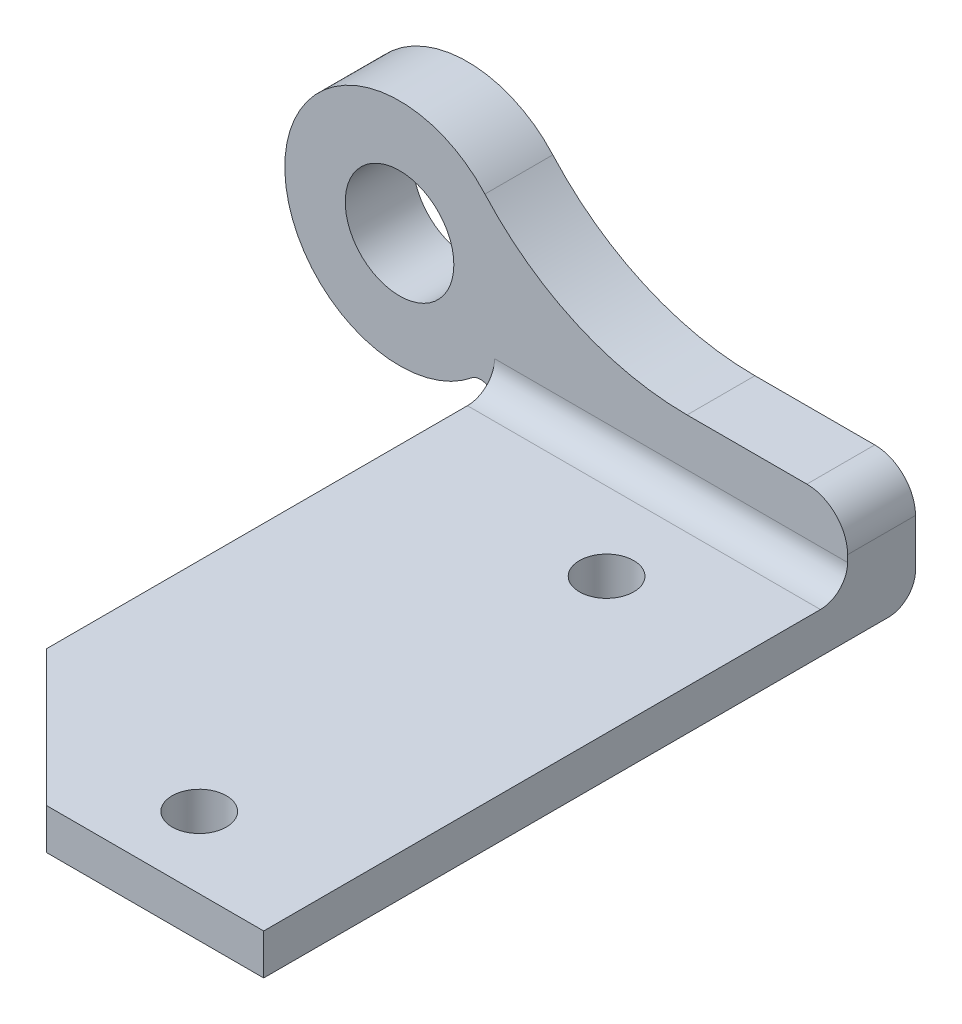
ISO-10303-21;
HEADER;
FILE_DESCRIPTION(('STEP AP214'),'2;1');
FILE_NAME('part.step','',(''),(''),'','','');
FILE_SCHEMA(('AUTOMOTIVE_DESIGN { 1 0 10303 214 1 1 1 1 }'));
ENDSEC;
DATA;
#1=APPLICATION_CONTEXT('core data for automotive mechanical design processes');
#2=APPLICATION_PROTOCOL_DEFINITION('international standard','automotive_design',2000,#1);
#3=PRODUCT_CONTEXT('',#1,'mechanical');
#4=PRODUCT('Part','Part','',(#3));
#5=PRODUCT_RELATED_PRODUCT_CATEGORY('part','',(#4));
#6=PRODUCT_DEFINITION_FORMATION('','',#4);
#7=PRODUCT_DEFINITION_CONTEXT('part definition',#1,'design');
#8=PRODUCT_DEFINITION('design','',#6,#7);
#9=PRODUCT_DEFINITION_SHAPE('','',#8);
#10=(LENGTH_UNIT() NAMED_UNIT(*) SI_UNIT(.MILLI.,.METRE.));
#11=(NAMED_UNIT(*) PLANE_ANGLE_UNIT() SI_UNIT($,.RADIAN.));
#12=(NAMED_UNIT(*) SI_UNIT($,.STERADIAN.) SOLID_ANGLE_UNIT());
#13=UNCERTAINTY_MEASURE_WITH_UNIT(LENGTH_MEASURE(1.E-05),#10,'distance_accuracy_value','');
#14=(GEOMETRIC_REPRESENTATION_CONTEXT(3) GLOBAL_UNCERTAINTY_ASSIGNED_CONTEXT((#13)) GLOBAL_UNIT_ASSIGNED_CONTEXT((#10,
#11,#12)) REPRESENTATION_CONTEXT('',''));
#15=CARTESIAN_POINT('',(0.,0.,0.));
#16=DIRECTION('',(0.,0.,1.));
#17=DIRECTION('',(1.,0.,0.));
#18=AXIS2_PLACEMENT_3D('',#15,#16,#17);
#19=CARTESIAN_POINT('',(8.71716610809906,5.2407015789691,-2.));
#20=DIRECTION('',(0.,0.,1.));
#21=DIRECTION('',(1.,0.,0.));
#22=AXIS2_PLACEMENT_3D('',#19,#20,#21);
#23=CYLINDRICAL_SURFACE('',#22,20.0000000000031);
#24=DIRECTION('',(0.,0.,1.));
#25=VECTOR('',#24,1.);
#26=CARTESIAN_POINT('',(-6.16896150007952,-8.11606467761962,-2.));
#27=LINE('',#26,#25);
#28=CARTESIAN_POINT('',(-6.16896150007952,-8.11606467761962,-2.));
#29=VERTEX_POINT('',#28);
#30=CARTESIAN_POINT('',(-6.16896150007952,-8.11606467761962,3.));
#31=VERTEX_POINT('',#30);
#32=EDGE_CURVE('E210',#29,#31,#27,.T.);
#33=ORIENTED_EDGE('',*,*,#32,.T.);
#34=CARTESIAN_POINT('',(8.71716610809906,5.2407015789691,3.));
#35=DIRECTION('',(0.,0.,1.));
#36=DIRECTION('',(1.,0.,0.));
#37=AXIS2_PLACEMENT_3D('',#34,#35,#36);
#38=CIRCLE('',#37,20.0000000000031);
#39=CARTESIAN_POINT('',(8.71716610809906,-14.759298421034,3.));
#40=VERTEX_POINT('',#39);
#41=EDGE_CURVE('E172',#31,#40,#38,.T.);
#42=ORIENTED_EDGE('',*,*,#41,.T.);
#43=DIRECTION('',(0.,0.,1.));
#44=VECTOR('',#43,1.);
#45=CARTESIAN_POINT('',(8.71716610809906,-14.759298421034,-2.));
#46=LINE('',#45,#44);
#47=CARTESIAN_POINT('',(8.71716610809906,-14.759298421034,-2.));
#48=VERTEX_POINT('',#47);
#49=EDGE_CURVE('E211',#48,#40,#46,.T.);
#50=ORIENTED_EDGE('',*,*,#49,.F.);
#51=CARTESIAN_POINT('',(8.71716610809906,5.2407015789691,-2.));
#52=DIRECTION('',(0.,0.,1.));
#53=DIRECTION('',(1.,0.,0.));
#54=AXIS2_PLACEMENT_3D('',#51,#52,#53);
#55=CIRCLE('',#54,20.0000000000031);
#56=EDGE_CURVE('E192',#29,#48,#55,.T.);
#57=ORIENTED_EDGE('',*,*,#56,.F.);
#58=EDGE_LOOP('',(#33,#42,#50,#57));
#59=FACE_BOUND('',#58,.T.);
#60=ADVANCED_FACE('F45',(#59),#23,.F.);
#61=CARTESIAN_POINT('',(0.,-14.759298421034,-2.));
#62=DIRECTION('',(0.,1.,0.));
#63=DIRECTION('',(0.,0.,1.));
#64=AXIS2_PLACEMENT_3D('',#61,#62,#63);
#65=PLANE('',#64);
#66=ORIENTED_EDGE('',*,*,#49,.T.);
#67=DIRECTION('',(-1.,0.,0.));
#68=VECTOR('',#67,1.);
#69=CARTESIAN_POINT('',(0.,-14.759298421034,3.));
#70=LINE('',#69,#68);
#71=CARTESIAN_POINT('',(17.5416495854691,-14.759298421034,3.));
#72=VERTEX_POINT('',#71);
#73=EDGE_CURVE('E186',#72,#40,#70,.T.);
#74=ORIENTED_EDGE('',*,*,#73,.F.);
#75=DIRECTION('',(0.,0.,1.));
#76=VECTOR('',#75,1.);
#77=CARTESIAN_POINT('',(17.5416495854691,-14.759298421034,-2.));
#78=LINE('',#77,#76);
#79=CARTESIAN_POINT('',(17.5416495854691,-14.759298421034,-2.));
#80=VERTEX_POINT('',#79);
#81=EDGE_CURVE('E213',#80,#72,#78,.T.);
#82=ORIENTED_EDGE('',*,*,#81,.F.);
#83=DIRECTION('',(-1.,0.,0.));
#84=VECTOR('',#83,1.);
#85=CARTESIAN_POINT('',(0.,-14.759298421034,-2.));
#86=LINE('',#85,#84);
#87=EDGE_CURVE('E207',#80,#48,#86,.T.);
#88=ORIENTED_EDGE('',*,*,#87,.T.);
#89=EDGE_LOOP('',(#66,#74,#82,#88));
#90=FACE_BOUND('',#89,.T.);
#91=ADVANCED_FACE('F285',(#90),#65,.T.);
#92=CARTESIAN_POINT('',(17.5416495854691,-17.759298421034,-2.));
#93=DIRECTION('',(0.,0.,1.));
#94=DIRECTION('',(1.,0.,0.));
#95=AXIS2_PLACEMENT_3D('',#92,#93,#94);
#96=CYLINDRICAL_SURFACE('',#95,3.);
#97=ORIENTED_EDGE('',*,*,#81,.T.);
#98=CARTESIAN_POINT('',(17.5416495854691,-17.759298421034,3.));
#99=DIRECTION('',(0.,0.,1.));
#100=DIRECTION('',(1.,0.,0.));
#101=AXIS2_PLACEMENT_3D('',#98,#99,#100);
#102=CIRCLE('',#101,3.);
#103=CARTESIAN_POINT('',(20.5416495854691,-17.759298421034,3.));
#104=VERTEX_POINT('',#103);
#105=EDGE_CURVE('E183',#104,#72,#102,.T.);
#106=ORIENTED_EDGE('',*,*,#105,.F.);
#107=DIRECTION('',(0.,0.,1.));
#108=VECTOR('',#107,1.);
#109=CARTESIAN_POINT('',(20.5416495854691,-17.759298421034,-2.));
#110=LINE('',#109,#108);
#111=CARTESIAN_POINT('',(20.5416495854691,-17.759298421034,-2.));
#112=VERTEX_POINT('',#111);
#113=EDGE_CURVE('E215',#112,#104,#110,.T.);
#114=ORIENTED_EDGE('',*,*,#113,.F.);
#115=CARTESIAN_POINT('',(17.5416495854691,-17.759298421034,-2.));
#116=DIRECTION('',(0.,0.,1.));
#117=DIRECTION('',(1.,0.,0.));
#118=AXIS2_PLACEMENT_3D('',#115,#116,#117);
#119=CIRCLE('',#118,3.);
#120=EDGE_CURVE('E204',#112,#80,#119,.T.);
#121=ORIENTED_EDGE('',*,*,#120,.T.);
#122=EDGE_LOOP('',(#97,#106,#114,#121));
#123=FACE_BOUND('',#122,.T.);
#124=ADVANCED_FACE('F288',(#123),#96,.T.);
#125=CARTESIAN_POINT('',(20.5416495854691,0.,-2.));
#126=DIRECTION('',(1.,0.,0.));
#127=DIRECTION('',(0.,0.,-1.));
#128=AXIS2_PLACEMENT_3D('',#125,#126,#127);
#129=PLANE('',#128);
#130=DIRECTION('',(0.,0.,1.));
#131=VECTOR('',#130,1.);
#132=CARTESIAN_POINT('',(20.5416495854682,-23.2592984210307,-2.));
#133=LINE('',#132,#131);
#134=CARTESIAN_POINT('',(20.5416495854682,-23.2592984210307,0.));
#135=VERTEX_POINT('',#134);
#136=CARTESIAN_POINT('',(20.5416495854682,-23.2592984210307,46.0047828549212));
#137=VERTEX_POINT('',#136);
#138=EDGE_CURVE('E218',#135,#137,#133,.T.);
#139=ORIENTED_EDGE('',*,*,#138,.F.);
#140=CARTESIAN_POINT('',(20.5416495854691,-21.2592984210307,0.));
#141=DIRECTION('',(1.,0.,0.));
#142=DIRECTION('',(0.,0.,-1.));
#143=AXIS2_PLACEMENT_3D('',#140,#141,#142);
#144=CIRCLE('',#143,2.);
#145=CARTESIAN_POINT('',(20.5416495854691,-21.2592984210307,-2.));
#146=VERTEX_POINT('',#145);
#147=EDGE_CURVE('E237',#135,#146,#144,.T.);
#148=ORIENTED_EDGE('',*,*,#147,.T.);
#149=DIRECTION('',(0.,1.,0.));
#150=VECTOR('',#149,1.);
#151=CARTESIAN_POINT('',(20.5416495854691,0.,-2.));
#152=LINE('',#151,#150);
#153=EDGE_CURVE('E202',#146,#112,#152,.T.);
#154=ORIENTED_EDGE('',*,*,#153,.T.);
#155=ORIENTED_EDGE('',*,*,#113,.T.);
#156=DIRECTION('',(0.,1.,0.));
#157=VECTOR('',#156,1.);
#158=CARTESIAN_POINT('',(20.5416495854691,0.,3.));
#159=LINE('',#158,#157);
#160=CARTESIAN_POINT('',(20.5416495854691,-18.2592984210307,3.));
#161=VERTEX_POINT('',#160);
#162=EDGE_CURVE('E181',#161,#104,#159,.T.);
#163=ORIENTED_EDGE('',*,*,#162,.F.);
#164=CARTESIAN_POINT('',(20.5416495854691,-18.2592984210307,5.));
#165=DIRECTION('',(1.,0.,0.));
#166=DIRECTION('',(0.,0.,-1.));
#167=AXIS2_PLACEMENT_3D('',#164,#165,#166);
#168=CIRCLE('',#167,2.);
#169=CARTESIAN_POINT('',(20.5416495854682,-20.2592984210307,5.));
#170=VERTEX_POINT('',#169);
#171=EDGE_CURVE('E11',#161,#170,#168,.F.);
#172=ORIENTED_EDGE('',*,*,#171,.T.);
#173=DIRECTION('',(0.,0.,1.));
#174=VECTOR('',#173,1.);
#175=CARTESIAN_POINT('',(20.5416495854682,-20.2592984210307,46.0047828549212));
#176=LINE('',#175,#174);
#177=CARTESIAN_POINT('',(20.5416495854682,-20.2592984210307,46.0047828549212));
#178=VERTEX_POINT('',#177);
#179=EDGE_CURVE('E138',#170,#178,#176,.T.);
#180=ORIENTED_EDGE('',*,*,#179,.T.);
#181=DIRECTION('',(0.,-1.,0.));
#182=VECTOR('',#181,1.);
#183=CARTESIAN_POINT('',(20.5416495854682,-20.2592984210307,46.0047828549212));
#184=LINE('',#183,#182);
#185=EDGE_CURVE('E142',#178,#137,#184,.T.);
#186=ORIENTED_EDGE('',*,*,#185,.T.);
#187=EDGE_LOOP('',(#139,#148,#154,#155,#163,#172,#180,#186));
#188=FACE_BOUND('',#187,.T.);
#189=ADVANCED_FACE('F141',(#188),#129,.T.);
#190=CARTESIAN_POINT('',(0.,-23.2592984210307,-2.));
#191=DIRECTION('',(0.,1.,0.));
#192=DIRECTION('',(0.,0.,1.));
#193=AXIS2_PLACEMENT_3D('',#190,#191,#192);
#194=PLANE('',#193);
#195=DIRECTION('',(-0.999999983085607,0.,-0.000183926029933874));
#196=VECTOR('',#195,1.);
#197=CARTESIAN_POINT('',(20.5416495854682,-23.2592984210307,46.0047828549212));
#198=LINE('',#197,#196);
#199=CARTESIAN_POINT('',(4.5434891841508,-23.2592984210307,46.0018403767426));
#200=VERTEX_POINT('',#199);
#201=EDGE_CURVE('E158',#137,#200,#198,.T.);
#202=ORIENTED_EDGE('',*,*,#201,.T.);
#203=DIRECTION('',(0.707106781186546,0.,0.707106781186549));
#204=VECTOR('',#203,1.);
#205=CARTESIAN_POINT('',(4.54348918414873,-23.2592984210307,46.0018403767405));
#206=LINE('',#205,#204);
#207=CARTESIAN_POINT('',(-5.45835041453181,-23.2592984210307,36.0000007780627));
#208=VERTEX_POINT('',#207);
#209=EDGE_CURVE('E241',#200,#208,#206,.F.);
#210=ORIENTED_EDGE('',*,*,#209,.T.);
#211=DIRECTION('',(0.,0.,1.));
#212=VECTOR('',#211,1.);
#213=CARTESIAN_POINT('',(-5.45835041453181,-23.2592984210307,-2.));
#214=LINE('',#213,#212);
#215=CARTESIAN_POINT('',(-5.45835041453181,-23.2592984210307,0.));
#216=VERTEX_POINT('',#215);
#217=EDGE_CURVE('E220',#216,#208,#214,.T.);
#218=ORIENTED_EDGE('',*,*,#217,.F.);
#219=DIRECTION('',(-1.,0.,0.));
#220=VECTOR('',#219,1.);
#221=CARTESIAN_POINT('',(0.,-23.2592984210307,0.));
#222=LINE('',#221,#220);
#223=EDGE_CURVE('E235',#216,#135,#222,.F.);
#224=ORIENTED_EDGE('',*,*,#223,.T.);
#225=ORIENTED_EDGE('',*,*,#138,.T.);
#226=EDGE_LOOP('',(#202,#210,#218,#224,#225));
#227=FACE_BOUND('',#226,.T.);
#228=CARTESIAN_POINT('',(10.5416495854728,-23.2592984210307,10.7504394506908));
#229=DIRECTION('',(0.,-1.,0.));
#230=DIRECTION('',(0.,0.,-1.));
#231=AXIS2_PLACEMENT_3D('',#228,#229,#230);
#232=CIRCLE('',#231,2.);
#233=CARTESIAN_POINT('',(10.5416495854728,-23.2592984210307,8.75043945069076));
#234=VERTEX_POINT('',#233);
#235=EDGE_CURVE('E346',#234,#234,#232,.T.);
#236=ORIENTED_EDGE('',*,*,#235,.F.);
#237=EDGE_LOOP('',(#236));
#238=FACE_BOUND('',#237,.T.);
#239=CARTESIAN_POINT('',(10.5416495854727,-23.2592984210307,40.7504394506913));
#240=DIRECTION('',(0.,-1.,0.));
#241=DIRECTION('',(0.,0.,-1.));
#242=AXIS2_PLACEMENT_3D('',#239,#240,#241);
#243=CIRCLE('',#242,2.);
#244=CARTESIAN_POINT('',(10.5416495854727,-23.2592984210307,38.7504394506913));
#245=VERTEX_POINT('',#244);
#246=EDGE_CURVE('E348',#245,#245,#243,.T.);
#247=ORIENTED_EDGE('',*,*,#246,.F.);
#248=EDGE_LOOP('',(#247));
#249=FACE_BOUND('',#248,.T.);
#250=ADVANCED_FACE('F256',(#227,#238,#249),#194,.F.);
#251=CARTESIAN_POINT('',(-5.45835041456107,-7.51245318596319E-12,-2.));
#252=DIRECTION('',(-1.,-1.37632299420031E-12,0.));
#253=DIRECTION('',(1.37632299420031E-12,-1.,0.));
#254=AXIS2_PLACEMENT_3D('',#251,#252,#253);
#255=PLANE('',#254);
#256=ORIENTED_EDGE('',*,*,#217,.T.);
#257=DIRECTION('',(-1.37632299420031E-12,1.,0.));
#258=VECTOR('',#257,1.);
#259=CARTESIAN_POINT('',(-5.45835041456107,-7.50283380388278E-12,36.0000007780627));
#260=LINE('',#259,#258);
#261=CARTESIAN_POINT('',(-5.45835041453182,-20.2592984210307,36.0000007780627));
#262=VERTEX_POINT('',#261);
#263=EDGE_CURVE('E243',#208,#262,#260,.T.);
#264=ORIENTED_EDGE('',*,*,#263,.T.);
#265=DIRECTION('',(0.,0.,-1.));
#266=VECTOR('',#265,1.);
#267=CARTESIAN_POINT('',(-5.45835041453182,-20.2592984210307,46.0000007780621));
#268=LINE('',#267,#266);
#269=CARTESIAN_POINT('',(-5.45835041453181,-20.2592984210307,5.));
#270=VERTEX_POINT('',#269);
#271=EDGE_CURVE('E150',#262,#270,#268,.T.);
#272=ORIENTED_EDGE('',*,*,#271,.T.);
#273=CARTESIAN_POINT('',(-5.45835041453594,-18.2592984210307,5.));
#274=DIRECTION('',(-1.,-1.37632299420031E-12,0.));
#275=DIRECTION('',(1.37632299420031E-12,-1.,0.));
#276=AXIS2_PLACEMENT_3D('',#273,#274,#275);
#277=CIRCLE('',#276,2.);
#278=CARTESIAN_POINT('',(-5.45835041453181,-18.2592984210307,3.));
#279=VERTEX_POINT('',#278);
#280=EDGE_CURVE('E53',#270,#279,#277,.F.);
#281=ORIENTED_EDGE('',*,*,#280,.T.);
#282=DIRECTION('',(0.,-1.,0.));
#283=VECTOR('',#282,1.);
#284=CARTESIAN_POINT('',(-5.45835041453181,0.,3.));
#285=LINE('',#284,#283);
#286=CARTESIAN_POINT('',(-5.45835041453181,-21.0601545352171,3.));
#287=VERTEX_POINT('',#286);
#288=EDGE_CURVE('E60',#279,#287,#285,.T.);
#289=ORIENTED_EDGE('',*,*,#288,.T.);
#290=DIRECTION('',(0.,0.,1.));
#291=VECTOR('',#290,1.);
#292=CARTESIAN_POINT('',(-5.45835041453209,-21.0601545352137,-2.));
#293=LINE('',#292,#291);
#294=CARTESIAN_POINT('',(-5.45835041453209,-21.0601545352137,-2.));
#295=VERTEX_POINT('',#294);
#296=EDGE_CURVE('E223',#295,#287,#293,.T.);
#297=ORIENTED_EDGE('',*,*,#296,.F.);
#298=DIRECTION('',(1.37632299420031E-12,-1.,0.));
#299=VECTOR('',#298,1.);
#300=CARTESIAN_POINT('',(-5.45835041456107,-7.51245318596319E-12,-2.));
#301=LINE('',#300,#299);
#302=CARTESIAN_POINT('',(-5.45835041453181,-21.2592984210307,-2.));
#303=VERTEX_POINT('',#302);
#304=EDGE_CURVE('E199',#295,#303,#301,.T.);
#305=ORIENTED_EDGE('',*,*,#304,.T.);
#306=CARTESIAN_POINT('',(-5.45835041453181,-21.2592984210307,0.));
#307=DIRECTION('',(-1.,-1.37632299420031E-12,0.));
#308=DIRECTION('',(1.37632299420031E-12,-1.,0.));
#309=AXIS2_PLACEMENT_3D('',#306,#307,#308);
#310=CIRCLE('',#309,2.);
#311=EDGE_CURVE('E233',#303,#216,#310,.T.);
#312=ORIENTED_EDGE('',*,*,#311,.T.);
#313=EDGE_LOOP('',(#256,#264,#272,#281,#289,#297,#305,#312));
#314=FACE_BOUND('',#313,.T.);
#315=ADVANCED_FACE('F250',(#314),#255,.T.);
#316=CARTESIAN_POINT('',(-6.49822931459182,-21.1445458718312,-2.));
#317=DIRECTION('',(0.,0.,1.));
#318=DIRECTION('',(1.,0.,0.));
#319=AXIS2_PLACEMENT_3D('',#316,#317,#318);
#320=CYLINDRICAL_SURFACE('',#319,1.0432976682067);
#321=ORIENTED_EDGE('',*,*,#296,.T.);
#322=CARTESIAN_POINT('',(-6.49822931459182,-21.1445458718312,3.));
#323=DIRECTION('',(0.,0.,1.));
#324=DIRECTION('',(1.,0.,0.));
#325=AXIS2_PLACEMENT_3D('',#322,#323,#324);
#326=CIRCLE('',#325,1.0432976682067);
#327=CARTESIAN_POINT('',(-7.09327104945139,-20.2875771686332,3.));
#328=VERTEX_POINT('',#327);
#329=EDGE_CURVE('E178',#287,#328,#326,.T.);
#330=ORIENTED_EDGE('',*,*,#329,.T.);
#331=DIRECTION('',(0.,0.,1.));
#332=VECTOR('',#331,1.);
#333=CARTESIAN_POINT('',(-7.09327104945139,-20.2875771686332,-2.));
#334=LINE('',#333,#332);
#335=CARTESIAN_POINT('',(-7.09327104945139,-20.2875771686332,-2.));
#336=VERTEX_POINT('',#335);
#337=EDGE_CURVE('E226',#336,#328,#334,.T.);
#338=ORIENTED_EDGE('',*,*,#337,.F.);
#339=CARTESIAN_POINT('',(-6.49822931459182,-21.1445458718312,-2.));
#340=DIRECTION('',(0.,0.,1.));
#341=DIRECTION('',(1.,0.,0.));
#342=AXIS2_PLACEMENT_3D('',#339,#340,#341);
#343=CIRCLE('',#342,1.0432976682067);
#344=EDGE_CURVE('E197',#295,#336,#343,.T.);
#345=ORIENTED_EDGE('',*,*,#344,.F.);
#346=EDGE_LOOP('',(#321,#330,#338,#345));
#347=FACE_BOUND('',#346,.T.);
#348=ADVANCED_FACE('F273',(#347),#320,.F.);
#349=CARTESIAN_POINT('',(-12.4583504145318,-13.7592984210307,-2.));
#350=DIRECTION('',(0.,0.,1.));
#351=DIRECTION('',(1.,0.,0.));
#352=AXIS2_PLACEMENT_3D('',#349,#350,#351);
#353=CYLINDRICAL_SURFACE('',#352,4.);
#354=CARTESIAN_POINT('',(-12.4583504145318,-13.7592984210307,-2.));
#355=DIRECTION('',(0.,0.,1.));
#356=DIRECTION('',(1.,0.,0.));
#357=AXIS2_PLACEMENT_3D('',#354,#355,#356);
#358=CIRCLE('',#357,4.);
#359=CARTESIAN_POINT('',(-8.45835041453181,-13.7592984210307,-2.));
#360=VERTEX_POINT('',#359);
#361=EDGE_CURVE('E189',#360,#360,#358,.T.);
#362=ORIENTED_EDGE('',*,*,#361,.F.);
#363=EDGE_LOOP('',(#362));
#364=FACE_BOUND('',#363,.T.);
#365=CARTESIAN_POINT('',(-12.4583504145318,-13.7592984210307,3.));
#366=DIRECTION('',(0.,0.,1.));
#367=DIRECTION('',(1.,0.,0.));
#368=AXIS2_PLACEMENT_3D('',#365,#366,#367);
#369=CIRCLE('',#368,4.);
#370=CARTESIAN_POINT('',(-8.45835041453181,-13.7592984210307,3.));
#371=VERTEX_POINT('',#370);
#372=EDGE_CURVE('E159',#371,#371,#369,.T.);
#373=ORIENTED_EDGE('',*,*,#372,.T.);
#374=EDGE_LOOP('',(#373));
#375=FACE_BOUND('',#374,.T.);
#376=ADVANCED_FACE('F296',(#364,#375),#353,.F.);
#377=CARTESIAN_POINT('',(-12.4583504145309,-13.7592984210308,-2.));
#378=DIRECTION('',(0.,0.,1.));
#379=DIRECTION('',(1.,0.,0.));
#380=AXIS2_PLACEMENT_3D('',#377,#378,#379);
#381=CYLINDRICAL_SURFACE('',#380,8.44999999999993);
#382=ORIENTED_EDGE('',*,*,#337,.T.);
#383=CARTESIAN_POINT('',(-12.4583504145309,-13.7592984210308,3.));
#384=DIRECTION('',(0.,0.,1.));
#385=DIRECTION('',(1.,0.,0.));
#386=AXIS2_PLACEMENT_3D('',#383,#384,#385);
#387=CIRCLE('',#386,8.44999999999993);
#388=EDGE_CURVE('E175',#31,#328,#387,.T.);
#389=ORIENTED_EDGE('',*,*,#388,.F.);
#390=ORIENTED_EDGE('',*,*,#32,.F.);
#391=CARTESIAN_POINT('',(-12.4583504145309,-13.7592984210308,-2.));
#392=DIRECTION('',(0.,0.,1.));
#393=DIRECTION('',(1.,0.,0.));
#394=AXIS2_PLACEMENT_3D('',#391,#392,#393);
#395=CIRCLE('',#394,8.44999999999993);
#396=EDGE_CURVE('E194',#29,#336,#395,.T.);
#397=ORIENTED_EDGE('',*,*,#396,.T.);
#398=EDGE_LOOP('',(#382,#389,#390,#397));
#399=FACE_BOUND('',#398,.T.);
#400=ADVANCED_FACE('F279',(#399),#381,.T.);
#401=CARTESIAN_POINT('',(0.,0.,-2.));
#402=DIRECTION('',(0.,0.,1.));
#403=DIRECTION('',(1.,0.,0.));
#404=AXIS2_PLACEMENT_3D('',#401,#402,#403);
#405=PLANE('',#404);
#406=ORIENTED_EDGE('',*,*,#153,.F.);
#407=DIRECTION('',(-1.,0.,0.));
#408=VECTOR('',#407,1.);
#409=CARTESIAN_POINT('',(0.,-21.2592984210307,-2.));
#410=LINE('',#409,#408);
#411=EDGE_CURVE('E230',#146,#303,#410,.T.);
#412=ORIENTED_EDGE('',*,*,#411,.T.);
#413=ORIENTED_EDGE('',*,*,#304,.F.);
#414=ORIENTED_EDGE('',*,*,#344,.T.);
#415=ORIENTED_EDGE('',*,*,#396,.F.);
#416=ORIENTED_EDGE('',*,*,#56,.T.);
#417=ORIENTED_EDGE('',*,*,#87,.F.);
#418=ORIENTED_EDGE('',*,*,#120,.F.);
#419=EDGE_LOOP('',(#406,#412,#413,#414,#415,#416,#417,#418));
#420=FACE_BOUND('',#419,.T.);
#421=ORIENTED_EDGE('',*,*,#361,.T.);
#422=EDGE_LOOP('',(#421));
#423=FACE_BOUND('',#422,.T.);
#424=ADVANCED_FACE('F267',(#420,#423),#405,.F.);
#425=CARTESIAN_POINT('',(0.,0.,3.));
#426=DIRECTION('',(0.,0.,1.));
#427=DIRECTION('',(1.,0.,0.));
#428=AXIS2_PLACEMENT_3D('',#425,#426,#427);
#429=PLANE('',#428);
#430=ORIENTED_EDGE('',*,*,#288,.F.);
#431=DIRECTION('',(-1.,0.,0.));
#432=VECTOR('',#431,1.);
#433=CARTESIAN_POINT('',(20.5416495854682,-18.2592984210307,3.));
#434=LINE('',#433,#432);
#435=EDGE_CURVE('E65',#279,#161,#434,.F.);
#436=ORIENTED_EDGE('',*,*,#435,.T.);
#437=ORIENTED_EDGE('',*,*,#162,.T.);
#438=ORIENTED_EDGE('',*,*,#105,.T.);
#439=ORIENTED_EDGE('',*,*,#73,.T.);
#440=ORIENTED_EDGE('',*,*,#41,.F.);
#441=ORIENTED_EDGE('',*,*,#388,.T.);
#442=ORIENTED_EDGE('',*,*,#329,.F.);
#443=EDGE_LOOP('',(#430,#436,#437,#438,#439,#440,#441,#442));
#444=FACE_BOUND('',#443,.T.);
#445=ORIENTED_EDGE('',*,*,#372,.F.);
#446=EDGE_LOOP('',(#445));
#447=FACE_BOUND('',#446,.T.);
#448=ADVANCED_FACE('F290',(#444,#447),#429,.T.);
#449=CARTESIAN_POINT('',(20.5416495854682,-20.2592984210307,46.0047828549212));
#450=DIRECTION('',(-0.000183926029933874,0.,0.999999983085608));
#451=DIRECTION('',(0.999999983085608,0.,0.000183926029933874));
#452=AXIS2_PLACEMENT_3D('',#449,#450,#451);
#453=PLANE('',#452);
#454=DIRECTION('',(-0.999999983085607,0.,-0.000183926029933874));
#455=VECTOR('',#454,1.);
#456=CARTESIAN_POINT('',(20.5416495854682,-20.2592984210307,46.0047828549212));
#457=LINE('',#456,#455);
#458=CARTESIAN_POINT('',(4.54348918414667,-20.2592984210307,46.0018403767426));
#459=VERTEX_POINT('',#458);
#460=EDGE_CURVE('E149',#178,#459,#457,.T.);
#461=ORIENTED_EDGE('',*,*,#460,.T.);
#462=DIRECTION('',(1.37632299420031E-12,-1.,0.));
#463=VECTOR('',#462,1.);
#464=CARTESIAN_POINT('',(4.54348918414666,-20.2592984210527,46.0018403767426));
#465=LINE('',#464,#463);
#466=EDGE_CURVE('E239',#459,#200,#465,.T.);
#467=ORIENTED_EDGE('',*,*,#466,.T.);
#468=ORIENTED_EDGE('',*,*,#201,.F.);
#469=ORIENTED_EDGE('',*,*,#185,.F.);
#470=EDGE_LOOP('',(#461,#467,#468,#469));
#471=FACE_BOUND('',#470,.T.);
#472=ADVANCED_FACE('F154',(#471),#453,.T.);
#473=CARTESIAN_POINT('',(0.,-20.2592984210307,0.));
#474=DIRECTION('',(0.,1.,0.));
#475=DIRECTION('',(0.,0.,1.));
#476=AXIS2_PLACEMENT_3D('',#473,#474,#475);
#477=PLANE('',#476);
#478=CARTESIAN_POINT('',(10.5416495854728,-20.2592984210307,10.7504394506908));
#479=DIRECTION('',(0.,-1.,0.));
#480=DIRECTION('',(0.,0.,-1.));
#481=AXIS2_PLACEMENT_3D('',#478,#479,#480);
#482=CIRCLE('',#481,2.);
#483=CARTESIAN_POINT('',(10.5416495854728,-20.2592984210307,8.75043945069076));
#484=VERTEX_POINT('',#483);
#485=EDGE_CURVE('E343',#484,#484,#482,.T.);
#486=ORIENTED_EDGE('',*,*,#485,.T.);
#487=EDGE_LOOP('',(#486));
#488=FACE_BOUND('',#487,.T.);
#489=CARTESIAN_POINT('',(10.5416495854727,-20.2592984210307,40.7504394506913));
#490=DIRECTION('',(0.,-1.,0.));
#491=DIRECTION('',(0.,0.,-1.));
#492=AXIS2_PLACEMENT_3D('',#489,#490,#491);
#493=CIRCLE('',#492,2.);
#494=CARTESIAN_POINT('',(10.5416495854727,-20.2592984210307,38.7504394506913));
#495=VERTEX_POINT('',#494);
#496=EDGE_CURVE('E168',#495,#495,#493,.T.);
#497=ORIENTED_EDGE('',*,*,#496,.T.);
#498=EDGE_LOOP('',(#497));
#499=FACE_BOUND('',#498,.T.);
#500=ORIENTED_EDGE('',*,*,#179,.F.);
#501=DIRECTION('',(-1.,0.,0.));
#502=VECTOR('',#501,1.);
#503=CARTESIAN_POINT('',(-5.45835041453181,-20.2592984210307,5.));
#504=LINE('',#503,#502);
#505=EDGE_CURVE('E246',#170,#270,#504,.T.);
#506=ORIENTED_EDGE('',*,*,#505,.T.);
#507=ORIENTED_EDGE('',*,*,#271,.F.);
#508=DIRECTION('',(-0.707106781186546,0.,-0.707106781186549));
#509=VECTOR('',#508,1.);
#510=CARTESIAN_POINT('',(-20.729175596298,-20.2592984210307,20.7291755962979));
#511=LINE('',#510,#509);
#512=EDGE_CURVE('E164',#262,#459,#511,.F.);
#513=ORIENTED_EDGE('',*,*,#512,.T.);
#514=ORIENTED_EDGE('',*,*,#460,.F.);
#515=EDGE_LOOP('',(#500,#506,#507,#513,#514));
#516=FACE_BOUND('',#515,.T.);
#517=ADVANCED_FACE('F161',(#488,#499,#516),#477,.T.);
#518=CARTESIAN_POINT('',(10.5416495854727,-20.2592984210307,40.7504394506913));
#519=DIRECTION('',(0.,-1.,0.));
#520=DIRECTION('',(0.,0.,-1.));
#521=AXIS2_PLACEMENT_3D('',#518,#519,#520);
#522=CYLINDRICAL_SURFACE('',#521,2.);
#523=ORIENTED_EDGE('',*,*,#496,.F.);
#524=EDGE_LOOP('',(#523));
#525=FACE_BOUND('',#524,.T.);
#526=ORIENTED_EDGE('',*,*,#246,.T.);
#527=EDGE_LOOP('',(#526));
#528=FACE_BOUND('',#527,.T.);
#529=ADVANCED_FACE('F329',(#525,#528),#522,.F.);
#530=CARTESIAN_POINT('',(10.5416495854728,-20.2592984210307,10.7504394506908));
#531=DIRECTION('',(0.,-1.,0.));
#532=DIRECTION('',(0.,0.,-1.));
#533=AXIS2_PLACEMENT_3D('',#530,#531,#532);
#534=CYLINDRICAL_SURFACE('',#533,2.);
#535=ORIENTED_EDGE('',*,*,#485,.F.);
#536=EDGE_LOOP('',(#535));
#537=FACE_BOUND('',#536,.T.);
#538=ORIENTED_EDGE('',*,*,#235,.T.);
#539=EDGE_LOOP('',(#538));
#540=FACE_BOUND('',#539,.T.);
#541=ADVANCED_FACE('F333',(#537,#540),#534,.F.);
#542=CARTESIAN_POINT('',(0.,-21.2592984210307,0.));
#543=DIRECTION('',(-1.,0.,0.));
#544=DIRECTION('',(0.,0.,1.));
#545=AXIS2_PLACEMENT_3D('',#542,#543,#544);
#546=CYLINDRICAL_SURFACE('',#545,2.);
#547=ORIENTED_EDGE('',*,*,#147,.F.);
#548=ORIENTED_EDGE('',*,*,#223,.F.);
#549=ORIENTED_EDGE('',*,*,#311,.F.);
#550=ORIENTED_EDGE('',*,*,#411,.F.);
#551=EDGE_LOOP('',(#547,#548,#549,#550));
#552=FACE_BOUND('',#551,.T.);
#553=ADVANCED_FACE('F264',(#552),#546,.T.);
#554=CARTESIAN_POINT('',(4.54348918414666,-20.2592984210527,46.0018403767426));
#555=DIRECTION('',(0.707106781186549,9.73028324139892E-13,-0.707106781186546));
#556=DIRECTION('',(1.37632299420031E-12,-1.,0.));
#557=AXIS2_PLACEMENT_3D('',#554,#555,#556);
#558=PLANE('',#557);
#559=ORIENTED_EDGE('',*,*,#512,.F.);
#560=ORIENTED_EDGE('',*,*,#263,.F.);
#561=ORIENTED_EDGE('',*,*,#209,.F.);
#562=ORIENTED_EDGE('',*,*,#466,.F.);
#563=EDGE_LOOP('',(#559,#560,#561,#562));
#564=FACE_BOUND('',#563,.T.);
#565=ADVANCED_FACE('F254',(#564),#558,.F.);
#566=CARTESIAN_POINT('',(0.,-18.2592984210307,5.));
#567=DIRECTION('',(1.,0.,0.));
#568=DIRECTION('',(0.,0.,-1.));
#569=AXIS2_PLACEMENT_3D('',#566,#567,#568);
#570=CYLINDRICAL_SURFACE('',#569,2.);
#571=ORIENTED_EDGE('',*,*,#171,.F.);
#572=ORIENTED_EDGE('',*,*,#435,.F.);
#573=ORIENTED_EDGE('',*,*,#280,.F.);
#574=ORIENTED_EDGE('',*,*,#505,.F.);
#575=EDGE_LOOP('',(#571,#572,#573,#574));
#576=FACE_BOUND('',#575,.T.);
#577=ADVANCED_FACE('F47',(#576),#570,.F.);
#578=CLOSED_SHELL('',(#60,#91,#124,#189,#250,#315,#348,#376,#400,#424,#448,#472,#517,#529,#541,
#553,#565,#577));
#579=MANIFOLD_SOLID_BREP('B2',#578);
#580=ADVANCED_BREP_SHAPE_REPRESENTATION('',(#18,#579),#14);
#581=SHAPE_DEFINITION_REPRESENTATION(#9,#580);
ENDSEC;
END-ISO-10303-21;
